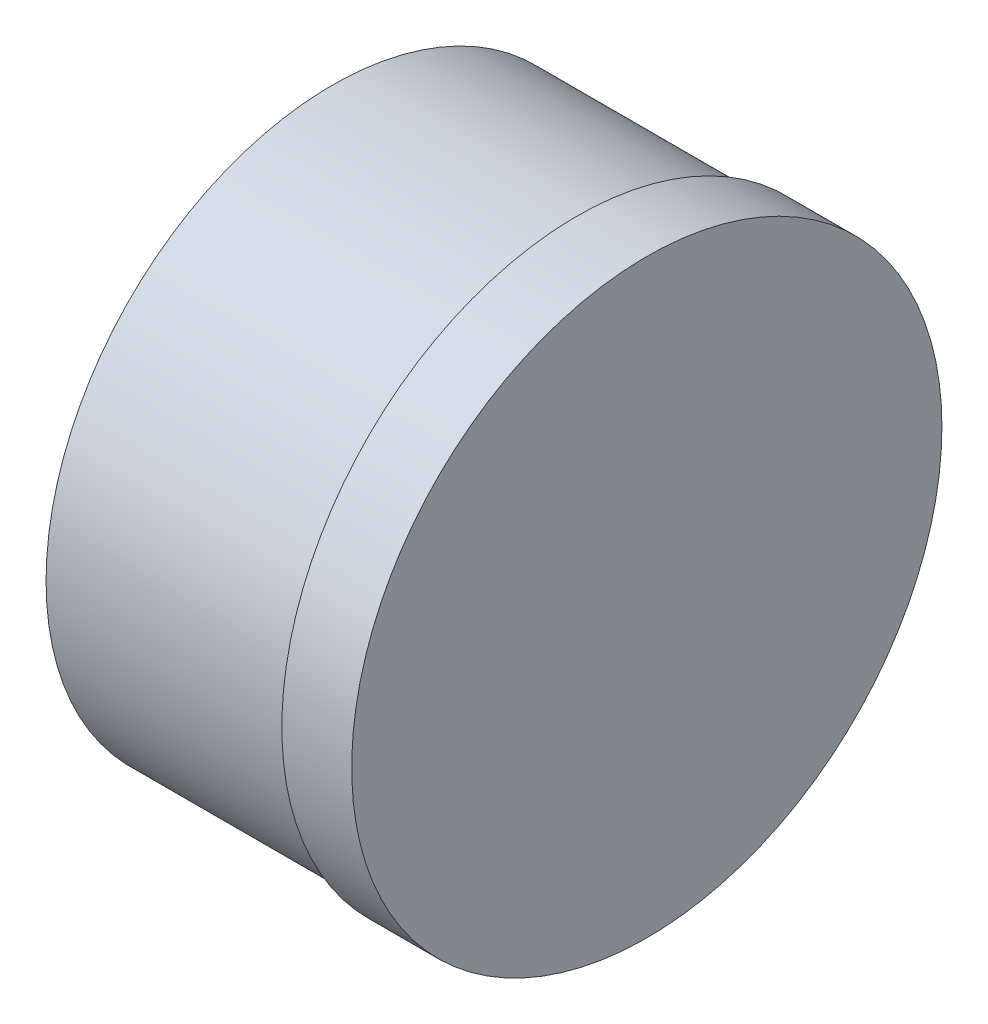
ISO-10303-21;
HEADER;
FILE_DESCRIPTION(('STEP AP214'),'2;1');
FILE_NAME('part.step','',(''),(''),'','','');
FILE_SCHEMA(('AUTOMOTIVE_DESIGN { 1 0 10303 214 1 1 1 1 }'));
ENDSEC;
DATA;
#1=APPLICATION_CONTEXT('core data for automotive mechanical design processes');
#2=APPLICATION_PROTOCOL_DEFINITION('international standard','automotive_design',2000,#1);
#3=PRODUCT_CONTEXT('',#1,'mechanical');
#4=PRODUCT('Part','Part','',(#3));
#5=PRODUCT_RELATED_PRODUCT_CATEGORY('part','',(#4));
#6=PRODUCT_DEFINITION_FORMATION('','',#4);
#7=PRODUCT_DEFINITION_CONTEXT('part definition',#1,'design');
#8=PRODUCT_DEFINITION('design','',#6,#7);
#9=PRODUCT_DEFINITION_SHAPE('','',#8);
#10=(LENGTH_UNIT() NAMED_UNIT(*) SI_UNIT(.MILLI.,.METRE.));
#11=(NAMED_UNIT(*) PLANE_ANGLE_UNIT() SI_UNIT($,.RADIAN.));
#12=(NAMED_UNIT(*) SI_UNIT($,.STERADIAN.) SOLID_ANGLE_UNIT());
#13=UNCERTAINTY_MEASURE_WITH_UNIT(LENGTH_MEASURE(1.E-05),#10,'distance_accuracy_value','');
#14=(GEOMETRIC_REPRESENTATION_CONTEXT(3) GLOBAL_UNCERTAINTY_ASSIGNED_CONTEXT((#13)) GLOBAL_UNIT_ASSIGNED_CONTEXT((#10,
#11,#12)) REPRESENTATION_CONTEXT('',''));
#15=CARTESIAN_POINT('',(0.,0.,0.));
#16=DIRECTION('',(0.,0.,1.));
#17=DIRECTION('',(1.,0.,0.));
#18=AXIS2_PLACEMENT_3D('',#15,#16,#17);
#19=CARTESIAN_POINT('',(35.,0.,0.));
#20=DIRECTION('',(-1.,0.,0.));
#21=DIRECTION('',(0.,0.,1.));
#22=AXIS2_PLACEMENT_3D('',#19,#20,#21);
#23=CYLINDRICAL_SURFACE('',#22,41.);
#24=CARTESIAN_POINT('',(35.,0.,0.));
#25=DIRECTION('',(1.,0.,0.));
#26=DIRECTION('',(0.,0.,-1.));
#27=AXIS2_PLACEMENT_3D('',#24,#25,#26);
#28=CIRCLE('',#27,41.);
#29=CARTESIAN_POINT('',(35.,0.,-41.));
#30=VERTEX_POINT('',#29);
#31=EDGE_CURVE('E10',#30,#30,#28,.T.);
#32=ORIENTED_EDGE('',*,*,#31,.F.);
#33=EDGE_LOOP('',(#32));
#34=FACE_BOUND('',#33,.T.);
#35=CARTESIAN_POINT('',(0.,0.,0.));
#36=DIRECTION('',(1.,0.,0.));
#37=DIRECTION('',(0.,0.,-1.));
#38=AXIS2_PLACEMENT_3D('',#35,#36,#37);
#39=CIRCLE('',#38,41.);
#40=CARTESIAN_POINT('',(0.,0.,-41.));
#41=VERTEX_POINT('',#40);
#42=EDGE_CURVE('E36',#41,#41,#39,.T.);
#43=ORIENTED_EDGE('',*,*,#42,.T.);
#44=EDGE_LOOP('',(#43));
#45=FACE_BOUND('',#44,.T.);
#46=ADVANCED_FACE('F33',(#34,#45),#23,.T.);
#47=CARTESIAN_POINT('',(0.,0.,0.));
#48=DIRECTION('',(1.,0.,0.));
#49=DIRECTION('',(0.,0.,-1.));
#50=AXIS2_PLACEMENT_3D('',#47,#48,#49);
#51=PLANE('',#50);
#52=ORIENTED_EDGE('',*,*,#42,.F.);
#53=EDGE_LOOP('',(#52));
#54=FACE_BOUND('',#53,.T.);
#55=ADVANCED_FACE('F56',(#54),#51,.F.);
#56=CARTESIAN_POINT('',(45.,0.,0.));
#57=DIRECTION('',(-1.,0.,0.));
#58=DIRECTION('',(0.,0.,1.));
#59=AXIS2_PLACEMENT_3D('',#56,#57,#58);
#60=CYLINDRICAL_SURFACE('',#59,42.25);
#61=CARTESIAN_POINT('',(45.,0.,0.));
#62=DIRECTION('',(1.,0.,0.));
#63=DIRECTION('',(0.,0.,-1.));
#64=AXIS2_PLACEMENT_3D('',#61,#62,#63);
#65=CIRCLE('',#64,42.25);
#66=CARTESIAN_POINT('',(45.,0.,-42.25));
#67=VERTEX_POINT('',#66);
#68=EDGE_CURVE('E43',#67,#67,#65,.T.);
#69=ORIENTED_EDGE('',*,*,#68,.F.);
#70=EDGE_LOOP('',(#69));
#71=FACE_BOUND('',#70,.T.);
#72=CARTESIAN_POINT('',(35.,0.,0.));
#73=DIRECTION('',(1.,0.,0.));
#74=DIRECTION('',(0.,0.,-1.));
#75=AXIS2_PLACEMENT_3D('',#72,#73,#74);
#76=CIRCLE('',#75,42.25);
#77=CARTESIAN_POINT('',(35.,0.,-42.25));
#78=VERTEX_POINT('',#77);
#79=EDGE_CURVE('E45',#78,#78,#76,.T.);
#80=ORIENTED_EDGE('',*,*,#79,.T.);
#81=EDGE_LOOP('',(#80));
#82=FACE_BOUND('',#81,.T.);
#83=ADVANCED_FACE('F53',(#71,#82),#60,.T.);
#84=CARTESIAN_POINT('',(45.,0.,0.));
#85=DIRECTION('',(1.,0.,0.));
#86=DIRECTION('',(0.,0.,-1.));
#87=AXIS2_PLACEMENT_3D('',#84,#85,#86);
#88=PLANE('',#87);
#89=ORIENTED_EDGE('',*,*,#68,.T.);
#90=EDGE_LOOP('',(#89));
#91=FACE_BOUND('',#90,.T.);
#92=ADVANCED_FACE('F51',(#91),#88,.T.);
#93=CARTESIAN_POINT('',(35.,0.,0.));
#94=DIRECTION('',(1.,0.,0.));
#95=DIRECTION('',(0.,0.,-1.));
#96=AXIS2_PLACEMENT_3D('',#93,#94,#95);
#97=PLANE('',#96);
#98=ORIENTED_EDGE('',*,*,#31,.T.);
#99=EDGE_LOOP('',(#98));
#100=FACE_BOUND('',#99,.T.);
#101=ORIENTED_EDGE('',*,*,#79,.F.);
#102=EDGE_LOOP('',(#101));
#103=FACE_BOUND('',#102,.T.);
#104=ADVANCED_FACE('F60',(#100,#103),#97,.F.);
#105=CLOSED_SHELL('',(#46,#55,#83,#92,#104));
#106=MANIFOLD_SOLID_BREP('B2',#105);
#107=ADVANCED_BREP_SHAPE_REPRESENTATION('',(#18,#106),#14);
#108=SHAPE_DEFINITION_REPRESENTATION(#9,#107);
ENDSEC;
END-ISO-10303-21;
